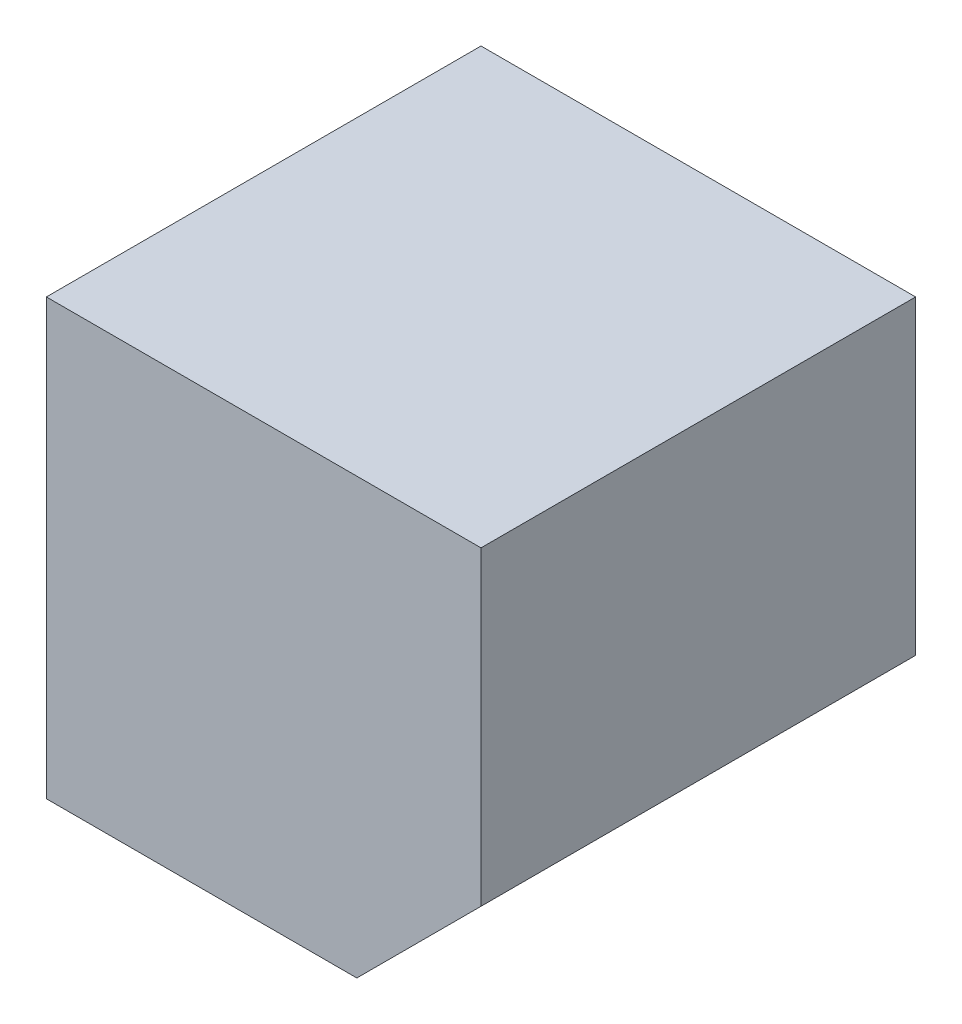
ISO-10303-21;
HEADER;
FILE_DESCRIPTION(('STEP AP214'),'2;1');
FILE_NAME('part.step','',(''),(''),'','','');
FILE_SCHEMA(('AUTOMOTIVE_DESIGN { 1 0 10303 214 1 1 1 1 }'));
ENDSEC;
DATA;
#1=APPLICATION_CONTEXT('core data for automotive mechanical design processes');
#2=APPLICATION_PROTOCOL_DEFINITION('international standard','automotive_design',2000,#1);
#3=PRODUCT_CONTEXT('',#1,'mechanical');
#4=PRODUCT('Part','Part','',(#3));
#5=PRODUCT_RELATED_PRODUCT_CATEGORY('part','',(#4));
#6=PRODUCT_DEFINITION_FORMATION('','',#4);
#7=PRODUCT_DEFINITION_CONTEXT('part definition',#1,'design');
#8=PRODUCT_DEFINITION('design','',#6,#7);
#9=PRODUCT_DEFINITION_SHAPE('','',#8);
#10=(LENGTH_UNIT() NAMED_UNIT(*) SI_UNIT(.MILLI.,.METRE.));
#11=(NAMED_UNIT(*) PLANE_ANGLE_UNIT() SI_UNIT($,.RADIAN.));
#12=(NAMED_UNIT(*) SI_UNIT($,.STERADIAN.) SOLID_ANGLE_UNIT());
#13=UNCERTAINTY_MEASURE_WITH_UNIT(LENGTH_MEASURE(1.E-05),#10,'distance_accuracy_value','');
#14=(GEOMETRIC_REPRESENTATION_CONTEXT(3) GLOBAL_UNCERTAINTY_ASSIGNED_CONTEXT((#13)) GLOBAL_UNIT_ASSIGNED_CONTEXT((#10,
#11,#12)) REPRESENTATION_CONTEXT('',''));
#15=CARTESIAN_POINT('',(0.,0.,0.));
#16=DIRECTION('',(0.,0.,1.));
#17=DIRECTION('',(1.,0.,0.));
#18=AXIS2_PLACEMENT_3D('',#15,#16,#17);
#19=CARTESIAN_POINT('',(-889.,889.,889.));
#20=DIRECTION('',(1.,0.,0.));
#21=DIRECTION('',(0.,1.,0.));
#22=AXIS2_PLACEMENT_3D('',#19,#20,#21);
#23=PLANE('',#22);
#24=DIRECTION('',(0.,-1.,0.));
#25=VECTOR('',#24,1.);
#26=CARTESIAN_POINT('',(-889.,889.,-889.));
#27=LINE('',#26,#25);
#28=CARTESIAN_POINT('',(-889.,889.,-889.));
#29=VERTEX_POINT('',#28);
#30=CARTESIAN_POINT('',(-889.,-889.,-889.));
#31=VERTEX_POINT('',#30);
#32=EDGE_CURVE('E107',#29,#31,#27,.T.);
#33=ORIENTED_EDGE('',*,*,#32,.T.);
#34=DIRECTION('',(0.,0.,-1.));
#35=VECTOR('',#34,1.);
#36=CARTESIAN_POINT('',(-889.,-889.,889.));
#37=LINE('',#36,#35);
#38=CARTESIAN_POINT('',(-889.,-889.,889.));
#39=VERTEX_POINT('',#38);
#40=EDGE_CURVE('E11',#39,#31,#37,.T.);
#41=ORIENTED_EDGE('',*,*,#40,.F.);
#42=DIRECTION('',(0.,-1.,0.));
#43=VECTOR('',#42,1.);
#44=CARTESIAN_POINT('',(-889.,889.,889.));
#45=LINE('',#44,#43);
#46=CARTESIAN_POINT('',(-889.,889.,889.));
#47=VERTEX_POINT('',#46);
#48=EDGE_CURVE('E115',#47,#39,#45,.T.);
#49=ORIENTED_EDGE('',*,*,#48,.F.);
#50=DIRECTION('',(0.,0.,-1.));
#51=VECTOR('',#50,1.);
#52=CARTESIAN_POINT('',(-889.,889.,889.));
#53=LINE('',#52,#51);
#54=EDGE_CURVE('E103',#47,#29,#53,.T.);
#55=ORIENTED_EDGE('',*,*,#54,.T.);
#56=EDGE_LOOP('',(#33,#41,#49,#55));
#57=FACE_BOUND('',#56,.T.);
#58=ADVANCED_FACE('F33',(#57),#23,.F.);
#59=CARTESIAN_POINT('',(381.,-889.000000000001,889.));
#60=DIRECTION('',(0.,1.,0.));
#61=DIRECTION('',(-1.,0.,0.));
#62=AXIS2_PLACEMENT_3D('',#59,#60,#61);
#63=PLANE('',#62);
#64=DIRECTION('',(1.,0.,0.));
#65=VECTOR('',#64,1.);
#66=CARTESIAN_POINT('',(381.,-889.000000000001,-889.));
#67=LINE('',#66,#65);
#68=CARTESIAN_POINT('',(381.,-889.000000000001,-889.));
#69=VERTEX_POINT('',#68);
#70=EDGE_CURVE('E110',#31,#69,#67,.T.);
#71=ORIENTED_EDGE('',*,*,#70,.T.);
#72=DIRECTION('',(0.,0.,-1.));
#73=VECTOR('',#72,1.);
#74=CARTESIAN_POINT('',(381.,-889.000000000001,889.));
#75=LINE('',#74,#73);
#76=CARTESIAN_POINT('',(381.,-889.000000000001,889.));
#77=VERTEX_POINT('',#76);
#78=EDGE_CURVE('E41',#77,#69,#75,.T.);
#79=ORIENTED_EDGE('',*,*,#78,.F.);
#80=DIRECTION('',(1.,0.,0.));
#81=VECTOR('',#80,1.);
#82=CARTESIAN_POINT('',(381.,-889.000000000001,889.));
#83=LINE('',#82,#81);
#84=EDGE_CURVE('E83',#39,#77,#83,.T.);
#85=ORIENTED_EDGE('',*,*,#84,.F.);
#86=ORIENTED_EDGE('',*,*,#40,.T.);
#87=EDGE_LOOP('',(#71,#79,#85,#86));
#88=FACE_BOUND('',#87,.T.);
#89=ADVANCED_FACE('F134',(#88),#63,.F.);
#90=CARTESIAN_POINT('',(381.,-889.000000000001,889.));
#91=DIRECTION('',(-0.707106781186548,0.707106781186547,0.));
#92=DIRECTION('',(-0.707106781186547,-0.707106781186548,0.));
#93=AXIS2_PLACEMENT_3D('',#90,#91,#92);
#94=PLANE('',#93);
#95=DIRECTION('',(0.707106781186547,0.707106781186548,0.));
#96=VECTOR('',#95,1.);
#97=CARTESIAN_POINT('',(381.,-889.000000000001,-889.));
#98=LINE('',#97,#96);
#99=CARTESIAN_POINT('',(889.000000000001,-380.999999999999,-889.));
#100=VERTEX_POINT('',#99);
#101=EDGE_CURVE('E98',#69,#100,#98,.T.);
#102=ORIENTED_EDGE('',*,*,#101,.T.);
#103=DIRECTION('',(0.,0.,-1.));
#104=VECTOR('',#103,1.);
#105=CARTESIAN_POINT('',(889.000000000001,-380.999999999999,889.));
#106=LINE('',#105,#104);
#107=CARTESIAN_POINT('',(889.000000000001,-380.999999999999,889.));
#108=VERTEX_POINT('',#107);
#109=EDGE_CURVE('E95',#108,#100,#106,.T.);
#110=ORIENTED_EDGE('',*,*,#109,.F.);
#111=DIRECTION('',(0.707106781186547,0.707106781186548,0.));
#112=VECTOR('',#111,1.);
#113=CARTESIAN_POINT('',(381.,-889.000000000001,889.));
#114=LINE('',#113,#112);
#115=EDGE_CURVE('E87',#77,#108,#114,.T.);
#116=ORIENTED_EDGE('',*,*,#115,.F.);
#117=ORIENTED_EDGE('',*,*,#78,.T.);
#118=EDGE_LOOP('',(#102,#110,#116,#117));
#119=FACE_BOUND('',#118,.T.);
#120=ADVANCED_FACE('F96',(#119),#94,.F.);
#121=CARTESIAN_POINT('',(889.,889.,889.));
#122=DIRECTION('',(-1.,0.,0.));
#123=DIRECTION('',(0.,-1.,0.));
#124=AXIS2_PLACEMENT_3D('',#121,#122,#123);
#125=PLANE('',#124);
#126=DIRECTION('',(0.,1.,0.));
#127=VECTOR('',#126,1.);
#128=CARTESIAN_POINT('',(889.,889.,-889.));
#129=LINE('',#128,#127);
#130=CARTESIAN_POINT('',(889.,889.,-889.));
#131=VERTEX_POINT('',#130);
#132=EDGE_CURVE('E69',#100,#131,#129,.T.);
#133=ORIENTED_EDGE('',*,*,#132,.T.);
#134=DIRECTION('',(0.,0.,-1.));
#135=VECTOR('',#134,1.);
#136=CARTESIAN_POINT('',(889.,889.,889.));
#137=LINE('',#136,#135);
#138=CARTESIAN_POINT('',(889.,889.,889.));
#139=VERTEX_POINT('',#138);
#140=EDGE_CURVE('E99',#139,#131,#137,.T.);
#141=ORIENTED_EDGE('',*,*,#140,.F.);
#142=DIRECTION('',(0.,1.,0.));
#143=VECTOR('',#142,1.);
#144=CARTESIAN_POINT('',(889.,889.,889.));
#145=LINE('',#144,#143);
#146=EDGE_CURVE('E91',#108,#139,#145,.T.);
#147=ORIENTED_EDGE('',*,*,#146,.F.);
#148=ORIENTED_EDGE('',*,*,#109,.T.);
#149=EDGE_LOOP('',(#133,#141,#147,#148));
#150=FACE_BOUND('',#149,.T.);
#151=ADVANCED_FACE('F101',(#150),#125,.F.);
#152=CARTESIAN_POINT('',(889.,889.,889.));
#153=DIRECTION('',(0.,-1.,0.));
#154=DIRECTION('',(1.,0.,0.));
#155=AXIS2_PLACEMENT_3D('',#152,#153,#154);
#156=PLANE('',#155);
#157=DIRECTION('',(-1.,0.,0.));
#158=VECTOR('',#157,1.);
#159=CARTESIAN_POINT('',(889.,889.,-889.));
#160=LINE('',#159,#158);
#161=EDGE_CURVE('E75',#131,#29,#160,.T.);
#162=ORIENTED_EDGE('',*,*,#161,.T.);
#163=ORIENTED_EDGE('',*,*,#54,.F.);
#164=DIRECTION('',(-1.,0.,0.));
#165=VECTOR('',#164,1.);
#166=CARTESIAN_POINT('',(889.,889.,889.));
#167=LINE('',#166,#165);
#168=EDGE_CURVE('E49',#139,#47,#167,.T.);
#169=ORIENTED_EDGE('',*,*,#168,.F.);
#170=ORIENTED_EDGE('',*,*,#140,.T.);
#171=EDGE_LOOP('',(#162,#163,#169,#170));
#172=FACE_BOUND('',#171,.T.);
#173=ADVANCED_FACE('F123',(#172),#156,.F.);
#174=CARTESIAN_POINT('',(0.,0.,889.));
#175=DIRECTION('',(0.,0.,-1.));
#176=DIRECTION('',(-1.,0.,0.));
#177=AXIS2_PLACEMENT_3D('',#174,#175,#176);
#178=PLANE('',#177);
#179=ORIENTED_EDGE('',*,*,#48,.T.);
#180=ORIENTED_EDGE('',*,*,#84,.T.);
#181=ORIENTED_EDGE('',*,*,#115,.T.);
#182=ORIENTED_EDGE('',*,*,#146,.T.);
#183=ORIENTED_EDGE('',*,*,#168,.T.);
#184=EDGE_LOOP('',(#179,#180,#181,#182,#183));
#185=FACE_BOUND('',#184,.T.);
#186=ADVANCED_FACE('F89',(#185),#178,.F.);
#187=CARTESIAN_POINT('',(0.,0.,-889.));
#188=DIRECTION('',(0.,0.,-1.));
#189=DIRECTION('',(-1.,0.,0.));
#190=AXIS2_PLACEMENT_3D('',#187,#188,#189);
#191=PLANE('',#190);
#192=ORIENTED_EDGE('',*,*,#32,.F.);
#193=ORIENTED_EDGE('',*,*,#161,.F.);
#194=ORIENTED_EDGE('',*,*,#132,.F.);
#195=ORIENTED_EDGE('',*,*,#101,.F.);
#196=ORIENTED_EDGE('',*,*,#70,.F.);
#197=EDGE_LOOP('',(#192,#193,#194,#195,#196));
#198=FACE_BOUND('',#197,.T.);
#199=ADVANCED_FACE('F119',(#198),#191,.T.);
#200=CLOSED_SHELL('',(#58,#89,#120,#151,#173,#186,#199));
#201=MANIFOLD_SOLID_BREP('B2',#200);
#202=ADVANCED_BREP_SHAPE_REPRESENTATION('',(#18,#201),#14);
#203=SHAPE_DEFINITION_REPRESENTATION(#9,#202);
ENDSEC;
END-ISO-10303-21;
